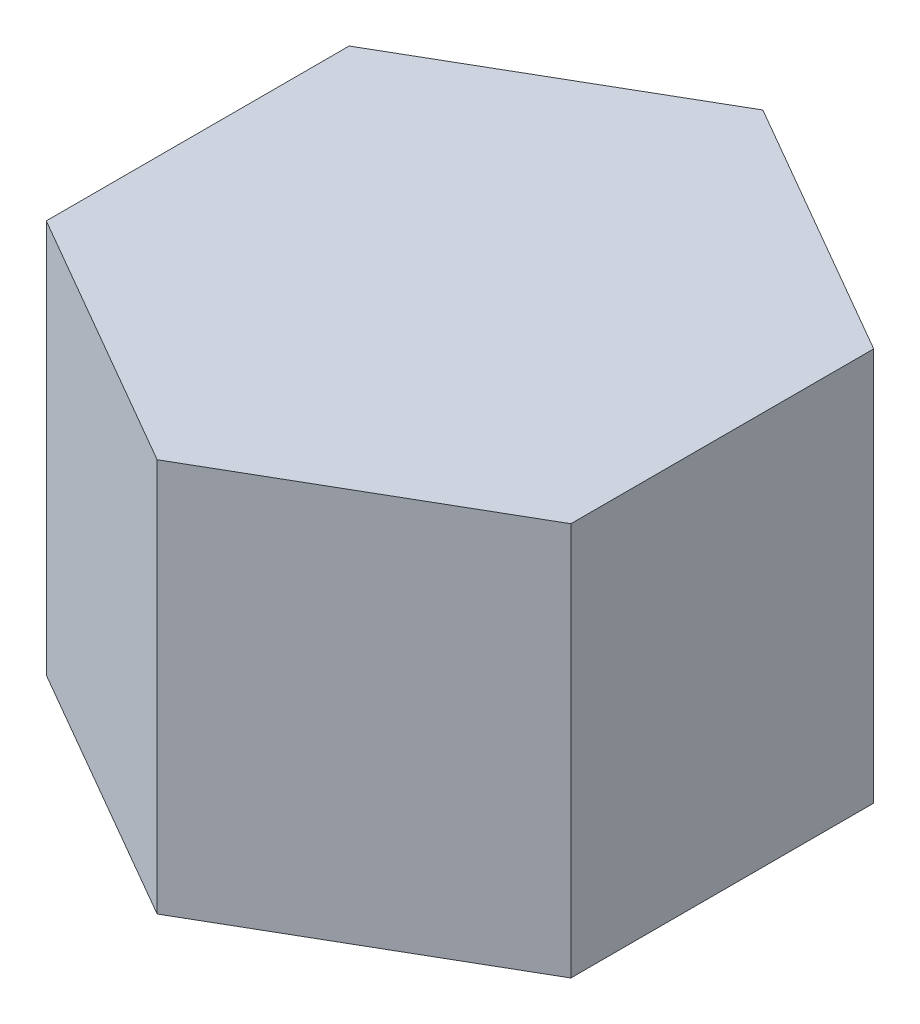
ISO-10303-21;
HEADER;
FILE_DESCRIPTION(('STEP AP214'),'2;1');
FILE_NAME('part.step','',(''),(''),'','','');
FILE_SCHEMA(('AUTOMOTIVE_DESIGN { 1 0 10303 214 1 1 1 1 }'));
ENDSEC;
DATA;
#1=APPLICATION_CONTEXT('core data for automotive mechanical design processes');
#2=APPLICATION_PROTOCOL_DEFINITION('international standard','automotive_design',2000,#1);
#3=PRODUCT_CONTEXT('',#1,'mechanical');
#4=PRODUCT('Part','Part','',(#3));
#5=PRODUCT_RELATED_PRODUCT_CATEGORY('part','',(#4));
#6=PRODUCT_DEFINITION_FORMATION('','',#4);
#7=PRODUCT_DEFINITION_CONTEXT('part definition',#1,'design');
#8=PRODUCT_DEFINITION('design','',#6,#7);
#9=PRODUCT_DEFINITION_SHAPE('','',#8);
#10=(LENGTH_UNIT() NAMED_UNIT(*) SI_UNIT(.MILLI.,.METRE.));
#11=(NAMED_UNIT(*) PLANE_ANGLE_UNIT() SI_UNIT($,.RADIAN.));
#12=(NAMED_UNIT(*) SI_UNIT($,.STERADIAN.) SOLID_ANGLE_UNIT());
#13=UNCERTAINTY_MEASURE_WITH_UNIT(LENGTH_MEASURE(1.E-05),#10,'distance_accuracy_value','');
#14=(GEOMETRIC_REPRESENTATION_CONTEXT(3) GLOBAL_UNCERTAINTY_ASSIGNED_CONTEXT((#13)) GLOBAL_UNIT_ASSIGNED_CONTEXT((#10,
#11,#12)) REPRESENTATION_CONTEXT('',''));
#15=CARTESIAN_POINT('',(0.,0.,0.));
#16=DIRECTION('',(0.,0.,1.));
#17=DIRECTION('',(1.,0.,0.));
#18=AXIS2_PLACEMENT_3D('',#15,#16,#17);
#19=CARTESIAN_POINT('',(428.,-2.6,146.571796769725));
#20=DIRECTION('',(-0.5,0.,0.86602540378444));
#21=DIRECTION('',(-0.86602540378444,0.,-0.5));
#22=AXIS2_PLACEMENT_3D('',#19,#20,#21);
#23=PLANE('',#22);
#24=DIRECTION('',(-0.86602540378444,0.,-0.5));
#25=VECTOR('',#24,1.);
#26=CARTESIAN_POINT('',(428.,-20.6,146.571796769725));
#27=LINE('',#26,#25);
#28=CARTESIAN_POINT('',(428.,-20.6,146.571796769725));
#29=VERTEX_POINT('',#28);
#30=CARTESIAN_POINT('',(416.,-20.6,139.643593539449));
#31=VERTEX_POINT('',#30);
#32=EDGE_CURVE('E78',#29,#31,#27,.T.);
#33=ORIENTED_EDGE('',*,*,#32,.T.);
#34=DIRECTION('',(0.,-1.,0.));
#35=VECTOR('',#34,1.);
#36=CARTESIAN_POINT('',(416.,-2.6,139.643593539449));
#37=LINE('',#36,#35);
#38=CARTESIAN_POINT('',(416.,-2.6,139.643593539449));
#39=VERTEX_POINT('',#38);
#40=EDGE_CURVE('E11',#39,#31,#37,.T.);
#41=ORIENTED_EDGE('',*,*,#40,.F.);
#42=DIRECTION('',(-0.86602540378444,0.,-0.5));
#43=VECTOR('',#42,1.);
#44=CARTESIAN_POINT('',(428.,-2.6,146.571796769725));
#45=LINE('',#44,#43);
#46=CARTESIAN_POINT('',(428.,-2.6,146.571796769725));
#47=VERTEX_POINT('',#46);
#48=EDGE_CURVE('E79',#47,#39,#45,.T.);
#49=ORIENTED_EDGE('',*,*,#48,.F.);
#50=DIRECTION('',(0.,-1.,0.));
#51=VECTOR('',#50,1.);
#52=CARTESIAN_POINT('',(428.,-2.6,146.571796769725));
#53=LINE('',#52,#51);
#54=EDGE_CURVE('E73',#47,#29,#53,.T.);
#55=ORIENTED_EDGE('',*,*,#54,.T.);
#56=EDGE_LOOP('',(#33,#41,#49,#55));
#57=FACE_BOUND('',#56,.T.);
#58=ADVANCED_FACE('F17',(#57),#23,.F.);
#59=CARTESIAN_POINT('',(416.,-2.6,139.643593539449));
#60=DIRECTION('',(0.5,0.,0.86602540378444));
#61=DIRECTION('',(-0.86602540378444,0.,0.5));
#62=AXIS2_PLACEMENT_3D('',#59,#60,#61);
#63=PLANE('',#62);
#64=DIRECTION('',(-0.86602540378444,0.,0.5));
#65=VECTOR('',#64,1.);
#66=CARTESIAN_POINT('',(416.,-20.6,139.643593539449));
#67=LINE('',#66,#65);
#68=CARTESIAN_POINT('',(404.,-20.6,146.571796769725));
#69=VERTEX_POINT('',#68);
#70=EDGE_CURVE('E87',#31,#69,#67,.T.);
#71=ORIENTED_EDGE('',*,*,#70,.T.);
#72=DIRECTION('',(0.,-1.,0.));
#73=VECTOR('',#72,1.);
#74=CARTESIAN_POINT('',(404.,-2.6,146.571796769725));
#75=LINE('',#74,#73);
#76=CARTESIAN_POINT('',(404.,-2.6,146.571796769725));
#77=VERTEX_POINT('',#76);
#78=EDGE_CURVE('E25',#77,#69,#75,.T.);
#79=ORIENTED_EDGE('',*,*,#78,.F.);
#80=DIRECTION('',(-0.86602540378444,0.,0.5));
#81=VECTOR('',#80,1.);
#82=CARTESIAN_POINT('',(416.,-2.6,139.643593539449));
#83=LINE('',#82,#81);
#84=EDGE_CURVE('E82',#39,#77,#83,.T.);
#85=ORIENTED_EDGE('',*,*,#84,.F.);
#86=ORIENTED_EDGE('',*,*,#40,.T.);
#87=EDGE_LOOP('',(#71,#79,#85,#86));
#88=FACE_BOUND('',#87,.T.);
#89=ADVANCED_FACE('F118',(#88),#63,.F.);
#90=CARTESIAN_POINT('',(404.,-2.6,146.571796769725));
#91=DIRECTION('',(1.,0.,0.));
#92=DIRECTION('',(0.,0.,1.));
#93=AXIS2_PLACEMENT_3D('',#90,#91,#92);
#94=PLANE('',#93);
#95=DIRECTION('',(0.,0.,1.));
#96=VECTOR('',#95,1.);
#97=CARTESIAN_POINT('',(404.,-20.6,146.571796769725));
#98=LINE('',#97,#96);
#99=CARTESIAN_POINT('',(404.,-20.6,160.428203230275));
#100=VERTEX_POINT('',#99);
#101=EDGE_CURVE('E99',#69,#100,#98,.T.);
#102=ORIENTED_EDGE('',*,*,#101,.T.);
#103=DIRECTION('',(0.,-1.,0.));
#104=VECTOR('',#103,1.);
#105=CARTESIAN_POINT('',(404.,-2.6,160.428203230275));
#106=LINE('',#105,#104);
#107=CARTESIAN_POINT('',(404.,-2.6,160.428203230275));
#108=VERTEX_POINT('',#107);
#109=EDGE_CURVE('E90',#108,#100,#106,.T.);
#110=ORIENTED_EDGE('',*,*,#109,.F.);
#111=DIRECTION('',(0.,0.,1.));
#112=VECTOR('',#111,1.);
#113=CARTESIAN_POINT('',(404.,-2.6,146.571796769725));
#114=LINE('',#113,#112);
#115=EDGE_CURVE('E102',#77,#108,#114,.T.);
#116=ORIENTED_EDGE('',*,*,#115,.F.);
#117=ORIENTED_EDGE('',*,*,#78,.T.);
#118=EDGE_LOOP('',(#102,#110,#116,#117));
#119=FACE_BOUND('',#118,.T.);
#120=ADVANCED_FACE('F97',(#119),#94,.F.);
#121=CARTESIAN_POINT('',(404.,-2.6,160.428203230275));
#122=DIRECTION('',(0.5,0.,-0.86602540378444));
#123=DIRECTION('',(0.86602540378444,0.,0.5));
#124=AXIS2_PLACEMENT_3D('',#121,#122,#123);
#125=PLANE('',#124);
#126=DIRECTION('',(0.86602540378444,0.,0.5));
#127=VECTOR('',#126,1.);
#128=CARTESIAN_POINT('',(404.,-20.6,160.428203230275));
#129=LINE('',#128,#127);
#130=CARTESIAN_POINT('',(416.,-20.6,167.356406460551));
#131=VERTEX_POINT('',#130);
#132=EDGE_CURVE('E66',#100,#131,#129,.T.);
#133=ORIENTED_EDGE('',*,*,#132,.T.);
#134=DIRECTION('',(0.,-1.,0.));
#135=VECTOR('',#134,1.);
#136=CARTESIAN_POINT('',(416.,-2.6,167.356406460551));
#137=LINE('',#136,#135);
#138=CARTESIAN_POINT('',(416.,-2.6,167.356406460551));
#139=VERTEX_POINT('',#138);
#140=EDGE_CURVE('E61',#139,#131,#137,.T.);
#141=ORIENTED_EDGE('',*,*,#140,.F.);
#142=DIRECTION('',(0.86602540378444,0.,0.5));
#143=VECTOR('',#142,1.);
#144=CARTESIAN_POINT('',(404.,-2.6,160.428203230275));
#145=LINE('',#144,#143);
#146=EDGE_CURVE('E110',#108,#139,#145,.T.);
#147=ORIENTED_EDGE('',*,*,#146,.F.);
#148=ORIENTED_EDGE('',*,*,#109,.T.);
#149=EDGE_LOOP('',(#133,#141,#147,#148));
#150=FACE_BOUND('',#149,.T.);
#151=ADVANCED_FACE('F127',(#150),#125,.F.);
#152=CARTESIAN_POINT('',(416.,-2.6,167.356406460551));
#153=DIRECTION('',(-0.5,0.,-0.86602540378444));
#154=DIRECTION('',(0.86602540378444,0.,-0.5));
#155=AXIS2_PLACEMENT_3D('',#152,#153,#154);
#156=PLANE('',#155);
#157=DIRECTION('',(0.86602540378444,0.,-0.5));
#158=VECTOR('',#157,1.);
#159=CARTESIAN_POINT('',(416.,-20.6,167.356406460551));
#160=LINE('',#159,#158);
#161=CARTESIAN_POINT('',(428.,-20.6,160.428203230275));
#162=VERTEX_POINT('',#161);
#163=EDGE_CURVE('E55',#131,#162,#160,.T.);
#164=ORIENTED_EDGE('',*,*,#163,.T.);
#165=DIRECTION('',(0.,-1.,0.));
#166=VECTOR('',#165,1.);
#167=CARTESIAN_POINT('',(428.,-2.6,160.428203230275));
#168=LINE('',#167,#166);
#169=CARTESIAN_POINT('',(428.,-2.6,160.428203230275));
#170=VERTEX_POINT('',#169);
#171=EDGE_CURVE('E58',#170,#162,#168,.T.);
#172=ORIENTED_EDGE('',*,*,#171,.F.);
#173=DIRECTION('',(0.86602540378444,0.,-0.5));
#174=VECTOR('',#173,1.);
#175=CARTESIAN_POINT('',(416.,-2.6,167.356406460551));
#176=LINE('',#175,#174);
#177=EDGE_CURVE('E32',#139,#170,#176,.T.);
#178=ORIENTED_EDGE('',*,*,#177,.F.);
#179=ORIENTED_EDGE('',*,*,#140,.T.);
#180=EDGE_LOOP('',(#164,#172,#178,#179));
#181=FACE_BOUND('',#180,.T.);
#182=ADVANCED_FACE('F57',(#181),#156,.F.);
#183=CARTESIAN_POINT('',(428.,-2.6,160.428203230275));
#184=DIRECTION('',(-1.,0.,0.));
#185=DIRECTION('',(0.,0.,-1.));
#186=AXIS2_PLACEMENT_3D('',#183,#184,#185);
#187=PLANE('',#186);
#188=DIRECTION('',(0.,0.,-1.));
#189=VECTOR('',#188,1.);
#190=CARTESIAN_POINT('',(428.,-20.6,160.428203230275));
#191=LINE('',#190,#189);
#192=EDGE_CURVE('E65',#162,#29,#191,.T.);
#193=ORIENTED_EDGE('',*,*,#192,.T.);
#194=ORIENTED_EDGE('',*,*,#54,.F.);
#195=DIRECTION('',(0.,0.,-1.));
#196=VECTOR('',#195,1.);
#197=CARTESIAN_POINT('',(428.,-2.6,160.428203230275));
#198=LINE('',#197,#196);
#199=EDGE_CURVE('E72',#170,#47,#198,.T.);
#200=ORIENTED_EDGE('',*,*,#199,.F.);
#201=ORIENTED_EDGE('',*,*,#171,.T.);
#202=EDGE_LOOP('',(#193,#194,#200,#201));
#203=FACE_BOUND('',#202,.T.);
#204=ADVANCED_FACE('F69',(#203),#187,.F.);
#205=CARTESIAN_POINT('',(416.,-20.6,153.5));
#206=DIRECTION('',(0.,1.,0.));
#207=DIRECTION('',(0.,0.,1.));
#208=AXIS2_PLACEMENT_3D('',#205,#206,#207);
#209=PLANE('',#208);
#210=ORIENTED_EDGE('',*,*,#32,.F.);
#211=ORIENTED_EDGE('',*,*,#192,.F.);
#212=ORIENTED_EDGE('',*,*,#163,.F.);
#213=ORIENTED_EDGE('',*,*,#132,.F.);
#214=ORIENTED_EDGE('',*,*,#101,.F.);
#215=ORIENTED_EDGE('',*,*,#70,.F.);
#216=EDGE_LOOP('',(#210,#211,#212,#213,#214,#215));
#217=FACE_BOUND('',#216,.T.);
#218=ADVANCED_FACE('F76',(#217),#209,.F.);
#219=CARTESIAN_POINT('',(0.,-2.6,0.));
#220=DIRECTION('',(0.,1.,0.));
#221=DIRECTION('',(0.,0.,1.));
#222=AXIS2_PLACEMENT_3D('',#219,#220,#221);
#223=PLANE('',#222);
#224=ORIENTED_EDGE('',*,*,#48,.T.);
#225=ORIENTED_EDGE('',*,*,#84,.T.);
#226=ORIENTED_EDGE('',*,*,#115,.T.);
#227=ORIENTED_EDGE('',*,*,#146,.T.);
#228=ORIENTED_EDGE('',*,*,#177,.T.);
#229=ORIENTED_EDGE('',*,*,#199,.T.);
#230=EDGE_LOOP('',(#224,#225,#226,#227,#228,#229));
#231=FACE_BOUND('',#230,.T.);
#232=ADVANCED_FACE('F114',(#231),#223,.T.);
#233=CLOSED_SHELL('',(#58,#89,#120,#151,#182,#204,#218,#232));
#234=MANIFOLD_SOLID_BREP('B1',#233);
#235=ADVANCED_BREP_SHAPE_REPRESENTATION('',(#18,#234),#14);
#236=SHAPE_DEFINITION_REPRESENTATION(#9,#235);
ENDSEC;
END-ISO-10303-21;
